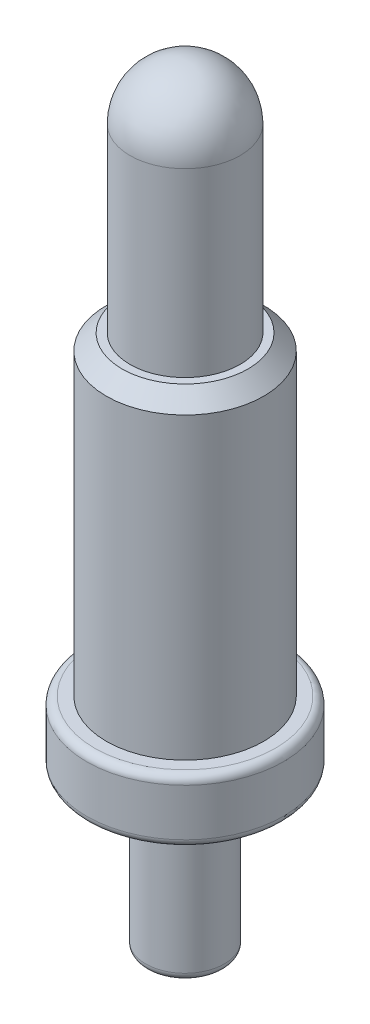
ISO-10303-21;
HEADER;
FILE_DESCRIPTION(('STEP AP214'),'2;1');
FILE_NAME('part.step','',(''),(''),'','','');
FILE_SCHEMA(('AUTOMOTIVE_DESIGN { 1 0 10303 214 1 1 1 1 }'));
ENDSEC;
DATA;
#1=APPLICATION_CONTEXT('core data for automotive mechanical design processes');
#2=APPLICATION_PROTOCOL_DEFINITION('international standard','automotive_design',2000,#1);
#3=PRODUCT_CONTEXT('',#1,'mechanical');
#4=PRODUCT('Part','Part','',(#3));
#5=PRODUCT_RELATED_PRODUCT_CATEGORY('part','',(#4));
#6=PRODUCT_DEFINITION_FORMATION('','',#4);
#7=PRODUCT_DEFINITION_CONTEXT('part definition',#1,'design');
#8=PRODUCT_DEFINITION('design','',#6,#7);
#9=PRODUCT_DEFINITION_SHAPE('','',#8);
#10=(LENGTH_UNIT() NAMED_UNIT(*) SI_UNIT(.MILLI.,.METRE.));
#11=(NAMED_UNIT(*) PLANE_ANGLE_UNIT() SI_UNIT($,.RADIAN.));
#12=(NAMED_UNIT(*) SI_UNIT($,.STERADIAN.) SOLID_ANGLE_UNIT());
#13=UNCERTAINTY_MEASURE_WITH_UNIT(LENGTH_MEASURE(1.E-05),#10,'distance_accuracy_value','');
#14=(GEOMETRIC_REPRESENTATION_CONTEXT(3) GLOBAL_UNCERTAINTY_ASSIGNED_CONTEXT((#13)) GLOBAL_UNIT_ASSIGNED_CONTEXT((#10,
#11,#12)) REPRESENTATION_CONTEXT('',''));
#15=CARTESIAN_POINT('',(0.,0.,0.));
#16=DIRECTION('',(0.,0.,1.));
#17=DIRECTION('',(1.,0.,0.));
#18=AXIS2_PLACEMENT_3D('',#15,#16,#17);
#19=CARTESIAN_POINT('',(0.,-2.,0.));
#20=DIRECTION('',(0.,1.,0.));
#21=DIRECTION('',(0.,0.,1.));
#22=AXIS2_PLACEMENT_3D('',#19,#20,#21);
#23=CYLINDRICAL_SURFACE('',#22,0.5);
#24=CARTESIAN_POINT('',(0.,-1.9,0.));
#25=DIRECTION('',(0.,1.,0.));
#26=DIRECTION('',(0.,0.,1.));
#27=AXIS2_PLACEMENT_3D('',#24,#25,#26);
#28=CIRCLE('',#27,0.5);
#29=CARTESIAN_POINT('',(0.,-1.9,0.5));
#30=VERTEX_POINT('',#29);
#31=EDGE_CURVE('E66',#30,#30,#28,.T.);
#32=ORIENTED_EDGE('',*,*,#31,.T.);
#33=EDGE_LOOP('',(#32));
#34=FACE_BOUND('',#33,.T.);
#35=CARTESIAN_POINT('',(0.,0.,0.));
#36=DIRECTION('',(0.,1.,0.));
#37=DIRECTION('',(0.,0.,1.));
#38=AXIS2_PLACEMENT_3D('',#35,#36,#37);
#39=CIRCLE('',#38,0.5);
#40=CARTESIAN_POINT('',(0.,0.,0.5));
#41=VERTEX_POINT('',#40);
#42=EDGE_CURVE('E83',#41,#41,#39,.T.);
#43=ORIENTED_EDGE('',*,*,#42,.F.);
#44=EDGE_LOOP('',(#43));
#45=FACE_BOUND('',#44,.T.);
#46=ADVANCED_FACE('F38',(#34,#45),#23,.T.);
#47=CARTESIAN_POINT('',(0.,-2.,0.));
#48=DIRECTION('',(0.,1.,0.));
#49=DIRECTION('',(0.,0.,1.));
#50=AXIS2_PLACEMENT_3D('',#47,#48,#49);
#51=PLANE('',#50);
#52=CARTESIAN_POINT('',(0.,-2.,0.));
#53=DIRECTION('',(0.,1.,0.));
#54=DIRECTION('',(0.,0.,1.));
#55=AXIS2_PLACEMENT_3D('',#52,#53,#54);
#56=CIRCLE('',#55,0.4);
#57=CARTESIAN_POINT('',(0.,-2.,0.4));
#58=VERTEX_POINT('',#57);
#59=EDGE_CURVE('E62',#58,#58,#56,.F.);
#60=ORIENTED_EDGE('',*,*,#59,.T.);
#61=EDGE_LOOP('',(#60));
#62=FACE_BOUND('',#61,.T.);
#63=ADVANCED_FACE('F113',(#62),#51,.F.);
#64=CARTESIAN_POINT('',(0.,0.8,0.));
#65=DIRECTION('',(0.,-1.,0.));
#66=DIRECTION('',(0.,0.,-1.));
#67=AXIS2_PLACEMENT_3D('',#64,#65,#66);
#68=CYLINDRICAL_SURFACE('',#67,1.25);
#69=CARTESIAN_POINT('',(0.,0.1,0.));
#70=DIRECTION('',(0.,1.,0.));
#71=DIRECTION('',(0.,0.,1.));
#72=AXIS2_PLACEMENT_3D('',#69,#70,#71);
#73=CIRCLE('',#72,1.25);
#74=CARTESIAN_POINT('',(0.,0.1,1.25));
#75=VERTEX_POINT('',#74);
#76=EDGE_CURVE('E51',#75,#75,#73,.T.);
#77=ORIENTED_EDGE('',*,*,#76,.T.);
#78=EDGE_LOOP('',(#77));
#79=FACE_BOUND('',#78,.T.);
#80=CARTESIAN_POINT('',(0.,0.7,0.));
#81=DIRECTION('',(0.,1.,0.));
#82=DIRECTION('',(0.,0.,1.));
#83=AXIS2_PLACEMENT_3D('',#80,#81,#82);
#84=CIRCLE('',#83,1.25);
#85=CARTESIAN_POINT('',(0.,0.7,1.25));
#86=VERTEX_POINT('',#85);
#87=EDGE_CURVE('E56',#86,#86,#84,.F.);
#88=ORIENTED_EDGE('',*,*,#87,.T.);
#89=EDGE_LOOP('',(#88));
#90=FACE_BOUND('',#89,.T.);
#91=ADVANCED_FACE('F119',(#79,#90),#68,.T.);
#92=CARTESIAN_POINT('',(0.,0.8,0.));
#93=DIRECTION('',(0.,1.,0.));
#94=DIRECTION('',(0.,0.,1.));
#95=AXIS2_PLACEMENT_3D('',#92,#93,#94);
#96=PLANE('',#95);
#97=CARTESIAN_POINT('',(0.,0.8,0.));
#98=DIRECTION('',(0.,1.,0.));
#99=DIRECTION('',(0.,0.,1.));
#100=AXIS2_PLACEMENT_3D('',#97,#98,#99);
#101=CIRCLE('',#100,1.15);
#102=CARTESIAN_POINT('',(0.,0.8,1.15));
#103=VERTEX_POINT('',#102);
#104=EDGE_CURVE('E10',#103,#103,#101,.T.);
#105=ORIENTED_EDGE('',*,*,#104,.T.);
#106=EDGE_LOOP('',(#105));
#107=FACE_BOUND('',#106,.T.);
#108=CARTESIAN_POINT('',(0.,0.8,0.));
#109=DIRECTION('',(0.,1.,0.));
#110=DIRECTION('',(0.,0.,1.));
#111=AXIS2_PLACEMENT_3D('',#108,#109,#110);
#112=CIRCLE('',#111,1.);
#113=CARTESIAN_POINT('',(0.,0.8,1.));
#114=VERTEX_POINT('',#113);
#115=EDGE_CURVE('E87',#114,#114,#112,.T.);
#116=ORIENTED_EDGE('',*,*,#115,.F.);
#117=EDGE_LOOP('',(#116));
#118=FACE_BOUND('',#117,.T.);
#119=ADVANCED_FACE('F150',(#107,#118),#96,.T.);
#120=CARTESIAN_POINT('',(0.,0.,0.));
#121=DIRECTION('',(0.,1.,0.));
#122=DIRECTION('',(0.,0.,1.));
#123=AXIS2_PLACEMENT_3D('',#120,#121,#122);
#124=PLANE('',#123);
#125=CARTESIAN_POINT('',(0.,0.,0.));
#126=DIRECTION('',(0.,1.,0.));
#127=DIRECTION('',(0.,0.,1.));
#128=AXIS2_PLACEMENT_3D('',#125,#126,#127);
#129=CIRCLE('',#128,1.15);
#130=CARTESIAN_POINT('',(0.,0.,1.15));
#131=VERTEX_POINT('',#130);
#132=EDGE_CURVE('E46',#131,#131,#129,.F.);
#133=ORIENTED_EDGE('',*,*,#132,.T.);
#134=EDGE_LOOP('',(#133));
#135=FACE_BOUND('',#134,.T.);
#136=ORIENTED_EDGE('',*,*,#42,.T.);
#137=EDGE_LOOP('',(#136));
#138=FACE_BOUND('',#137,.T.);
#139=ADVANCED_FACE('F109',(#135,#138),#124,.F.);
#140=CARTESIAN_POINT('',(0.,4.8,0.));
#141=DIRECTION('',(0.,-1.,0.));
#142=DIRECTION('',(0.,0.,-1.));
#143=AXIS2_PLACEMENT_3D('',#140,#141,#142);
#144=CYLINDRICAL_SURFACE('',#143,1.);
#145=CARTESIAN_POINT('',(0.,4.6,0.));
#146=DIRECTION('',(0.,1.,0.));
#147=DIRECTION('',(0.,0.,1.));
#148=AXIS2_PLACEMENT_3D('',#145,#146,#147);
#149=CIRCLE('',#148,1.);
#150=CARTESIAN_POINT('',(0.,4.6,1.));
#151=VERTEX_POINT('',#150);
#152=EDGE_CURVE('E70',#151,#151,#149,.F.);
#153=ORIENTED_EDGE('',*,*,#152,.T.);
#154=EDGE_LOOP('',(#153));
#155=FACE_BOUND('',#154,.T.);
#156=ORIENTED_EDGE('',*,*,#115,.T.);
#157=EDGE_LOOP('',(#156));
#158=FACE_BOUND('',#157,.T.);
#159=ADVANCED_FACE('F99',(#155,#158),#144,.T.);
#160=CARTESIAN_POINT('',(0.,4.8,0.));
#161=DIRECTION('',(0.,1.,0.));
#162=DIRECTION('',(0.,0.,1.));
#163=AXIS2_PLACEMENT_3D('',#160,#161,#162);
#164=PLANE('',#163);
#165=CARTESIAN_POINT('',(0.,4.8,0.));
#166=DIRECTION('',(0.,1.,0.));
#167=DIRECTION('',(0.,0.,1.));
#168=AXIS2_PLACEMENT_3D('',#165,#166,#167);
#169=CIRCLE('',#168,0.799999999999999);
#170=CARTESIAN_POINT('',(0.,4.8,0.799999999999999));
#171=VERTEX_POINT('',#170);
#172=EDGE_CURVE('E74',#171,#171,#169,.T.);
#173=ORIENTED_EDGE('',*,*,#172,.T.);
#174=EDGE_LOOP('',(#173));
#175=FACE_BOUND('',#174,.T.);
#176=CARTESIAN_POINT('',(0.,4.8,0.));
#177=DIRECTION('',(0.,1.,0.));
#178=DIRECTION('',(0.,0.,1.));
#179=AXIS2_PLACEMENT_3D('',#176,#177,#178);
#180=CIRCLE('',#179,0.7);
#181=CARTESIAN_POINT('',(0.,4.8,0.7));
#182=VERTEX_POINT('',#181);
#183=EDGE_CURVE('E82',#182,#182,#180,.T.);
#184=ORIENTED_EDGE('',*,*,#183,.F.);
#185=EDGE_LOOP('',(#184));
#186=FACE_BOUND('',#185,.T.);
#187=ADVANCED_FACE('F97',(#175,#186),#164,.T.);
#188=CARTESIAN_POINT('',(0.,7.8,0.));
#189=DIRECTION('',(0.,-1.,0.));
#190=DIRECTION('',(0.,0.,-1.));
#191=AXIS2_PLACEMENT_3D('',#188,#189,#190);
#192=CYLINDRICAL_SURFACE('',#191,0.7);
#193=CARTESIAN_POINT('',(0.,7.1,0.));
#194=DIRECTION('',(0.,-1.,0.));
#195=DIRECTION('',(0.,0.,-1.));
#196=AXIS2_PLACEMENT_3D('',#193,#194,#195);
#197=CIRCLE('',#196,0.7);
#198=CARTESIAN_POINT('',(0.,7.1,-0.7));
#199=VERTEX_POINT('',#198);
#200=EDGE_CURVE('E78',#199,#199,#197,.T.);
#201=ORIENTED_EDGE('',*,*,#200,.T.);
#202=EDGE_LOOP('',(#201));
#203=FACE_BOUND('',#202,.T.);
#204=ORIENTED_EDGE('',*,*,#183,.T.);
#205=EDGE_LOOP('',(#204));
#206=FACE_BOUND('',#205,.T.);
#207=ADVANCED_FACE('F95',(#203,#206),#192,.T.);
#208=CARTESIAN_POINT('',(0.,7.1,0.));
#209=DIRECTION('',(0.,1.,0.));
#210=DIRECTION('',(0.,0.,1.));
#211=AXIS2_PLACEMENT_3D('',#208,#209,#210);
#212=SPHERICAL_SURFACE('',#211,0.7);
#213=ORIENTED_EDGE('',*,*,#200,.F.);
#214=EDGE_LOOP('',(#213));
#215=FACE_BOUND('',#214,.T.);
#216=ADVANCED_FACE('F106',(#215),#212,.T.);
#217=CARTESIAN_POINT('',(0.,4.8,0.));
#218=DIRECTION('',(0.,-1.,0.));
#219=DIRECTION('',(0.,0.,-1.));
#220=AXIS2_PLACEMENT_3D('',#217,#218,#219);
#221=CONICAL_SURFACE('',#220,0.799999999999999,0.785398163397444);
#222=ORIENTED_EDGE('',*,*,#152,.F.);
#223=EDGE_LOOP('',(#222));
#224=FACE_BOUND('',#223,.T.);
#225=ORIENTED_EDGE('',*,*,#172,.F.);
#226=EDGE_LOOP('',(#225));
#227=FACE_BOUND('',#226,.T.);
#228=ADVANCED_FACE('F127',(#224,#227),#221,.T.);
#229=CARTESIAN_POINT('',(0.,-1.9,0.));
#230=DIRECTION('',(0.,1.,0.));
#231=DIRECTION('',(0.,0.,1.));
#232=AXIS2_PLACEMENT_3D('',#229,#230,#231);
#233=TOROIDAL_SURFACE('',#232,0.4,0.1);
#234=ORIENTED_EDGE('',*,*,#59,.F.);
#235=EDGE_LOOP('',(#234));
#236=FACE_BOUND('',#235,.T.);
#237=ORIENTED_EDGE('',*,*,#31,.F.);
#238=EDGE_LOOP('',(#237));
#239=FACE_BOUND('',#238,.T.);
#240=ADVANCED_FACE('F134',(#236,#239),#233,.T.);
#241=CARTESIAN_POINT('',(0.,0.1,0.));
#242=DIRECTION('',(0.,1.,0.));
#243=DIRECTION('',(0.,0.,1.));
#244=AXIS2_PLACEMENT_3D('',#241,#242,#243);
#245=TOROIDAL_SURFACE('',#244,1.15,0.1);
#246=ORIENTED_EDGE('',*,*,#132,.F.);
#247=EDGE_LOOP('',(#246));
#248=FACE_BOUND('',#247,.T.);
#249=ORIENTED_EDGE('',*,*,#76,.F.);
#250=EDGE_LOOP('',(#249));
#251=FACE_BOUND('',#250,.T.);
#252=ADVANCED_FACE('F137',(#248,#251),#245,.T.);
#253=CARTESIAN_POINT('',(0.,0.7,0.));
#254=DIRECTION('',(0.,1.,0.));
#255=DIRECTION('',(0.,0.,1.));
#256=AXIS2_PLACEMENT_3D('',#253,#254,#255);
#257=TOROIDAL_SURFACE('',#256,1.15,0.1);
#258=ORIENTED_EDGE('',*,*,#87,.F.);
#259=EDGE_LOOP('',(#258));
#260=FACE_BOUND('',#259,.T.);
#261=ORIENTED_EDGE('',*,*,#104,.F.);
#262=EDGE_LOOP('',(#261));
#263=FACE_BOUND('',#262,.T.);
#264=ADVANCED_FACE('F40',(#260,#263),#257,.T.);
#265=CLOSED_SHELL('',(#46,#63,#91,#119,#139,#159,#187,#207,#216,#228,#240,#252,#264));
#266=MANIFOLD_SOLID_BREP('B2',#265);
#267=ADVANCED_BREP_SHAPE_REPRESENTATION('',(#18,#266),#14);
#268=SHAPE_DEFINITION_REPRESENTATION(#9,#267);
ENDSEC;
END-ISO-10303-21;
